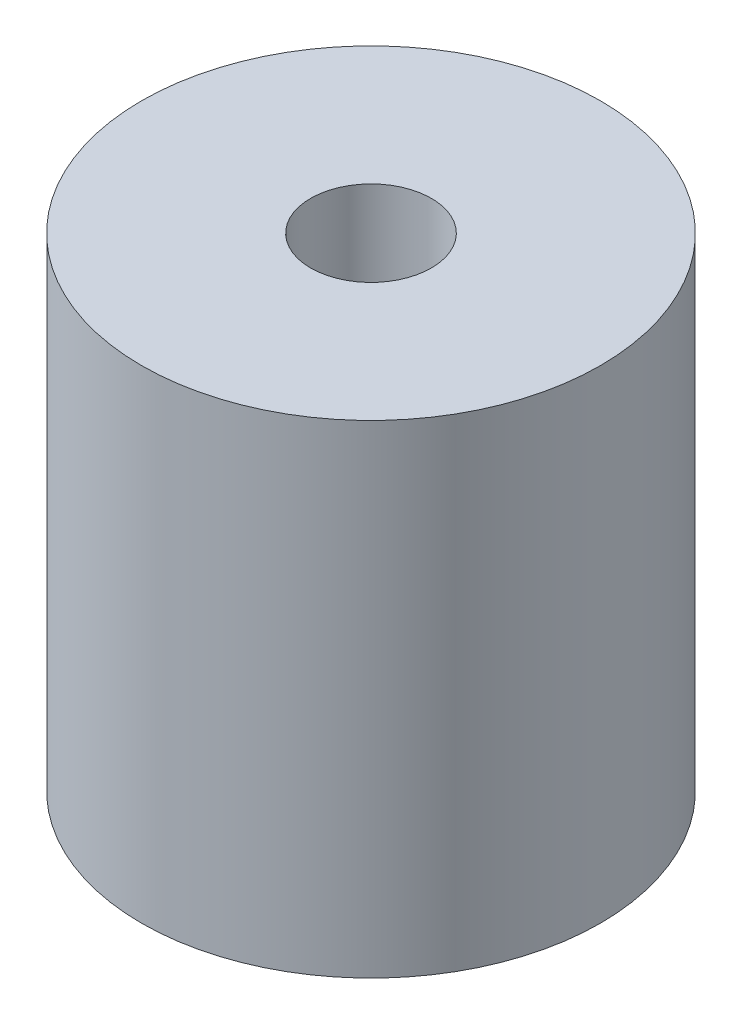
ISO-10303-21;
HEADER;
FILE_DESCRIPTION(('STEP AP214'),'2;1');
FILE_NAME('part.step','',(''),(''),'','','');
FILE_SCHEMA(('AUTOMOTIVE_DESIGN { 1 0 10303 214 1 1 1 1 }'));
ENDSEC;
DATA;
#1=APPLICATION_CONTEXT('core data for automotive mechanical design processes');
#2=APPLICATION_PROTOCOL_DEFINITION('international standard','automotive_design',2000,#1);
#3=PRODUCT_CONTEXT('',#1,'mechanical');
#4=PRODUCT('Part','Part','',(#3));
#5=PRODUCT_RELATED_PRODUCT_CATEGORY('part','',(#4));
#6=PRODUCT_DEFINITION_FORMATION('','',#4);
#7=PRODUCT_DEFINITION_CONTEXT('part definition',#1,'design');
#8=PRODUCT_DEFINITION('design','',#6,#7);
#9=PRODUCT_DEFINITION_SHAPE('','',#8);
#10=(LENGTH_UNIT() NAMED_UNIT(*) SI_UNIT(.MILLI.,.METRE.));
#11=(NAMED_UNIT(*) PLANE_ANGLE_UNIT() SI_UNIT($,.RADIAN.));
#12=(NAMED_UNIT(*) SI_UNIT($,.STERADIAN.) SOLID_ANGLE_UNIT());
#13=UNCERTAINTY_MEASURE_WITH_UNIT(LENGTH_MEASURE(1.E-05),#10,'distance_accuracy_value','');
#14=(GEOMETRIC_REPRESENTATION_CONTEXT(3) GLOBAL_UNCERTAINTY_ASSIGNED_CONTEXT((#13)) GLOBAL_UNIT_ASSIGNED_CONTEXT((#10,
#11,#12)) REPRESENTATION_CONTEXT('',''));
#15=CARTESIAN_POINT('',(0.,0.,0.));
#16=DIRECTION('',(0.,0.,1.));
#17=DIRECTION('',(1.,0.,0.));
#18=AXIS2_PLACEMENT_3D('',#15,#16,#17);
#19=CARTESIAN_POINT('',(0.,20.,0.));
#20=DIRECTION('',(0.,1.,0.));
#21=DIRECTION('',(0.,0.,1.));
#22=AXIS2_PLACEMENT_3D('',#19,#20,#21);
#23=PLANE('',#22);
#24=CARTESIAN_POINT('',(0.,20.,0.));
#25=DIRECTION('',(0.,1.,0.));
#26=DIRECTION('',(0.,0.,1.));
#27=AXIS2_PLACEMENT_3D('',#24,#25,#26);
#28=CIRCLE('',#27,9.5);
#29=CARTESIAN_POINT('',(0.,20.,9.5));
#30=VERTEX_POINT('',#29);
#31=EDGE_CURVE('E10',#30,#30,#28,.T.);
#32=ORIENTED_EDGE('',*,*,#31,.T.);
#33=EDGE_LOOP('',(#32));
#34=FACE_BOUND('',#33,.T.);
#35=CARTESIAN_POINT('',(0.,20.,0.));
#36=DIRECTION('',(0.,1.,0.));
#37=DIRECTION('',(0.,0.,1.));
#38=AXIS2_PLACEMENT_3D('',#35,#36,#37);
#39=CIRCLE('',#38,2.5);
#40=CARTESIAN_POINT('',(0.,20.,2.5));
#41=VERTEX_POINT('',#40);
#42=EDGE_CURVE('E46',#41,#41,#39,.T.);
#43=ORIENTED_EDGE('',*,*,#42,.F.);
#44=EDGE_LOOP('',(#43));
#45=FACE_BOUND('',#44,.T.);
#46=ADVANCED_FACE('F35',(#34,#45),#23,.T.);
#47=CARTESIAN_POINT('',(0.,0.,0.));
#48=DIRECTION('',(0.,1.,0.));
#49=DIRECTION('',(0.,0.,1.));
#50=AXIS2_PLACEMENT_3D('',#47,#48,#49);
#51=PLANE('',#50);
#52=CARTESIAN_POINT('',(0.,0.,0.));
#53=DIRECTION('',(0.,1.,0.));
#54=DIRECTION('',(0.,0.,1.));
#55=AXIS2_PLACEMENT_3D('',#52,#53,#54);
#56=CIRCLE('',#55,9.5);
#57=CARTESIAN_POINT('',(0.,0.,9.5));
#58=VERTEX_POINT('',#57);
#59=EDGE_CURVE('E39',#58,#58,#56,.T.);
#60=ORIENTED_EDGE('',*,*,#59,.F.);
#61=EDGE_LOOP('',(#60));
#62=FACE_BOUND('',#61,.T.);
#63=CARTESIAN_POINT('',(0.,0.,0.));
#64=DIRECTION('',(0.,1.,0.));
#65=DIRECTION('',(0.,0.,1.));
#66=AXIS2_PLACEMENT_3D('',#63,#64,#65);
#67=CIRCLE('',#66,2.5);
#68=CARTESIAN_POINT('',(0.,0.,2.5));
#69=VERTEX_POINT('',#68);
#70=EDGE_CURVE('E48',#69,#69,#67,.T.);
#71=ORIENTED_EDGE('',*,*,#70,.T.);
#72=EDGE_LOOP('',(#71));
#73=FACE_BOUND('',#72,.T.);
#74=ADVANCED_FACE('F58',(#62,#73),#51,.F.);
#75=CARTESIAN_POINT('',(0.,20.,0.));
#76=DIRECTION('',(0.,-1.,0.));
#77=DIRECTION('',(0.,0.,-1.));
#78=AXIS2_PLACEMENT_3D('',#75,#76,#77);
#79=CYLINDRICAL_SURFACE('',#78,9.5);
#80=ORIENTED_EDGE('',*,*,#31,.F.);
#81=EDGE_LOOP('',(#80));
#82=FACE_BOUND('',#81,.T.);
#83=ORIENTED_EDGE('',*,*,#59,.T.);
#84=EDGE_LOOP('',(#83));
#85=FACE_BOUND('',#84,.T.);
#86=ADVANCED_FACE('F37',(#82,#85),#79,.T.);
#87=CARTESIAN_POINT('',(0.,20.,0.));
#88=DIRECTION('',(0.,-1.,0.));
#89=DIRECTION('',(0.,0.,-1.));
#90=AXIS2_PLACEMENT_3D('',#87,#88,#89);
#91=CYLINDRICAL_SURFACE('',#90,2.5);
#92=ORIENTED_EDGE('',*,*,#42,.T.);
#93=EDGE_LOOP('',(#92));
#94=FACE_BOUND('',#93,.T.);
#95=ORIENTED_EDGE('',*,*,#70,.F.);
#96=EDGE_LOOP('',(#95));
#97=FACE_BOUND('',#96,.T.);
#98=ADVANCED_FACE('F54',(#94,#97),#91,.F.);
#99=CLOSED_SHELL('',(#46,#74,#86,#98));
#100=MANIFOLD_SOLID_BREP('B2',#99);
#101=ADVANCED_BREP_SHAPE_REPRESENTATION('',(#18,#100),#14);
#102=SHAPE_DEFINITION_REPRESENTATION(#9,#101);
ENDSEC;
END-ISO-10303-21;
